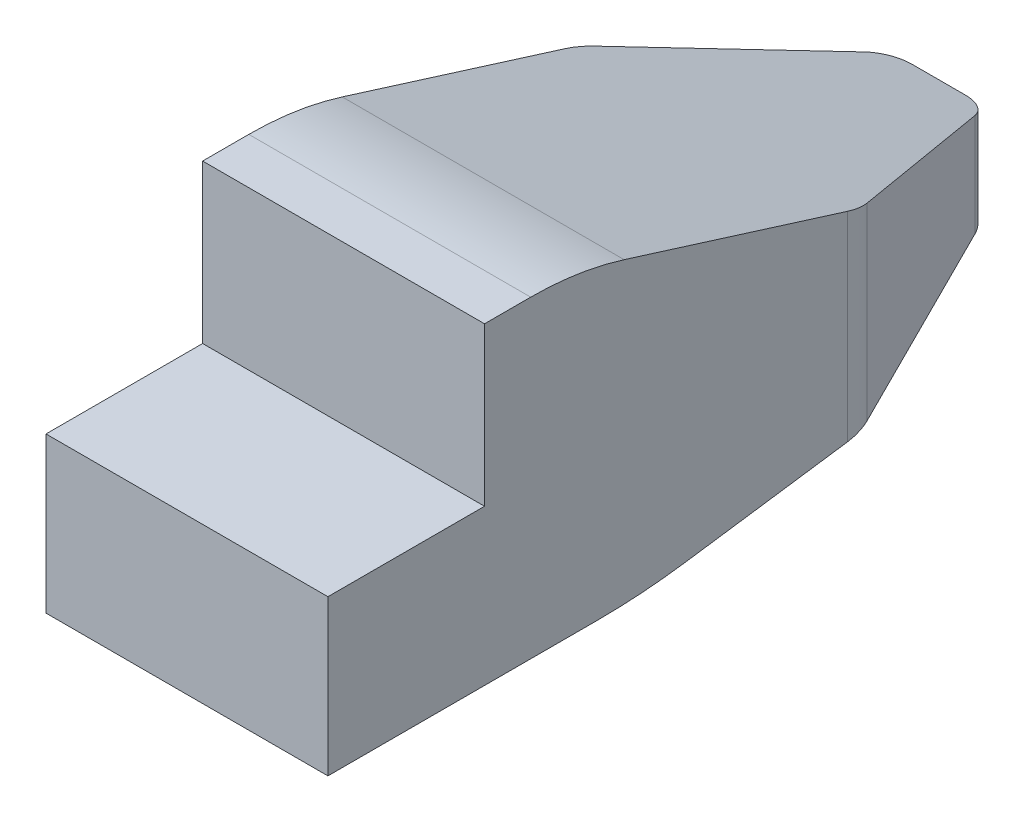
ISO-10303-21;
HEADER;
FILE_DESCRIPTION(('STEP AP214'),'2;1');
FILE_NAME('part.step','',(''),(''),'','','');
FILE_SCHEMA(('AUTOMOTIVE_DESIGN { 1 0 10303 214 1 1 1 1 }'));
ENDSEC;
DATA;
#1=APPLICATION_CONTEXT('core data for automotive mechanical design processes');
#2=APPLICATION_PROTOCOL_DEFINITION('international standard','automotive_design',2000,#1);
#3=PRODUCT_CONTEXT('',#1,'mechanical');
#4=PRODUCT('Part','Part','',(#3));
#5=PRODUCT_RELATED_PRODUCT_CATEGORY('part','',(#4));
#6=PRODUCT_DEFINITION_FORMATION('','',#4);
#7=PRODUCT_DEFINITION_CONTEXT('part definition',#1,'design');
#8=PRODUCT_DEFINITION('design','',#6,#7);
#9=PRODUCT_DEFINITION_SHAPE('','',#8);
#10=(LENGTH_UNIT() NAMED_UNIT(*) SI_UNIT(.MILLI.,.METRE.));
#11=(NAMED_UNIT(*) PLANE_ANGLE_UNIT() SI_UNIT($,.RADIAN.));
#12=(NAMED_UNIT(*) SI_UNIT($,.STERADIAN.) SOLID_ANGLE_UNIT());
#13=UNCERTAINTY_MEASURE_WITH_UNIT(LENGTH_MEASURE(1.E-05),#10,'distance_accuracy_value','');
#14=(GEOMETRIC_REPRESENTATION_CONTEXT(3) GLOBAL_UNCERTAINTY_ASSIGNED_CONTEXT((#13)) GLOBAL_UNIT_ASSIGNED_CONTEXT((#10,
#11,#12)) REPRESENTATION_CONTEXT('',''));
#15=CARTESIAN_POINT('',(0.,0.,0.));
#16=DIRECTION('',(0.,0.,1.));
#17=DIRECTION('',(1.,0.,0.));
#18=AXIS2_PLACEMENT_3D('',#15,#16,#17);
#19=CARTESIAN_POINT('',(9.,10.,0.));
#20=DIRECTION('',(-1.,0.,0.));
#21=DIRECTION('',(0.,0.,1.));
#22=AXIS2_PLACEMENT_3D('',#19,#20,#21);
#23=PLANE('',#22);
#24=DIRECTION('',(0.,-0.298274993135947,-0.95447997803503));
#25=VECTOR('',#24,1.);
#26=CARTESIAN_POINT('',(9.,11.3879003558719,-3.55871886120996));
#27=LINE('',#26,#25);
#28=CARTESIAN_POINT('',(9.,9.5447997803503,-9.45664070287905));
#29=VERTEX_POINT('',#28);
#30=CARTESIAN_POINT('',(9.,7.31578606372165,-16.5894845960907));
#31=VERTEX_POINT('',#30);
#32=EDGE_CURVE('E238',#29,#31,#27,.T.);
#33=ORIENTED_EDGE('',*,*,#32,.F.);
#34=CARTESIAN_POINT('',(9.,0.,-6.47389077151958));
#35=DIRECTION('',(-1.,0.,0.));
#36=DIRECTION('',(0.,0.,1.));
#37=AXIS2_PLACEMENT_3D('',#34,#35,#36);
#38=CIRCLE('',#37,10.);
#39=CARTESIAN_POINT('',(9.,10.,-6.47389077151958));
#40=VERTEX_POINT('',#39);
#41=EDGE_CURVE('E55',#29,#40,#38,.F.);
#42=ORIENTED_EDGE('',*,*,#41,.T.);
#43=DIRECTION('',(0.,0.,-1.));
#44=VECTOR('',#43,1.);
#45=CARTESIAN_POINT('',(9.,10.,0.));
#46=LINE('',#45,#44);
#47=CARTESIAN_POINT('',(9.,10.,-5.));
#48=VERTEX_POINT('',#47);
#49=EDGE_CURVE('E170',#48,#40,#46,.T.);
#50=ORIENTED_EDGE('',*,*,#49,.F.);
#51=DIRECTION('',(0.,1.,0.));
#52=VECTOR('',#51,1.);
#53=CARTESIAN_POINT('',(9.,4.95495,-5.));
#54=LINE('',#53,#52);
#55=CARTESIAN_POINT('',(9.,4.95495,-5.));
#56=VERTEX_POINT('',#55);
#57=EDGE_CURVE('E162',#56,#48,#54,.T.);
#58=ORIENTED_EDGE('',*,*,#57,.F.);
#59=DIRECTION('',(0.,0.,-1.));
#60=VECTOR('',#59,1.);
#61=CARTESIAN_POINT('',(9.,4.95495,0.));
#62=LINE('',#61,#60);
#63=CARTESIAN_POINT('',(9.,4.95495,0.));
#64=VERTEX_POINT('',#63);
#65=EDGE_CURVE('E149',#64,#56,#62,.T.);
#66=ORIENTED_EDGE('',*,*,#65,.F.);
#67=DIRECTION('',(0.,-1.,0.));
#68=VECTOR('',#67,1.);
#69=CARTESIAN_POINT('',(9.,10.,0.));
#70=LINE('',#69,#68);
#71=CARTESIAN_POINT('',(9.,0.,0.));
#72=VERTEX_POINT('',#71);
#73=EDGE_CURVE('E160',#64,#72,#70,.T.);
#74=ORIENTED_EDGE('',*,*,#73,.T.);
#75=DIRECTION('',(0.,0.,-1.));
#76=VECTOR('',#75,1.);
#77=CARTESIAN_POINT('',(9.,0.,0.));
#78=LINE('',#77,#76);
#79=CARTESIAN_POINT('',(9.,0.,-8.5786437626905));
#80=VERTEX_POINT('',#79);
#81=EDGE_CURVE('E177',#72,#80,#78,.T.);
#82=ORIENTED_EDGE('',*,*,#81,.T.);
#83=CARTESIAN_POINT('',(9.,20.,-8.5786437626905));
#84=DIRECTION('',(-1.,0.,0.));
#85=DIRECTION('',(0.,0.,1.));
#86=AXIS2_PLACEMENT_3D('',#83,#84,#85);
#87=CIRCLE('',#86,20.);
#88=CARTESIAN_POINT('',(9.,0.20101012677667,-11.4070708874367));
#89=VERTEX_POINT('',#88);
#90=EDGE_CURVE('E184',#80,#89,#87,.F.);
#91=ORIENTED_EDGE('',*,*,#90,.T.);
#92=DIRECTION('',(0.,-0.14142135623731,0.989949493661167));
#93=VECTOR('',#92,1.);
#94=CARTESIAN_POINT('',(9.,-1.4,-0.2));
#95=LINE('',#94,#93);
#96=CARTESIAN_POINT('',(9.,0.941354942298677,-16.5894845960907));
#97=VERTEX_POINT('',#96);
#98=EDGE_CURVE('E277',#97,#89,#95,.T.);
#99=ORIENTED_EDGE('',*,*,#98,.F.);
#100=DIRECTION('',(0.,-1.,0.));
#101=VECTOR('',#100,1.);
#102=CARTESIAN_POINT('',(9.,7.1875,-16.5894845960907));
#103=LINE('',#102,#101);
#104=EDGE_CURVE('E218',#97,#31,#103,.F.);
#105=ORIENTED_EDGE('',*,*,#104,.T.);
#106=EDGE_LOOP('',(#33,#42,#50,#58,#66,#74,#82,#91,#99,#105));
#107=FACE_BOUND('',#106,.T.);
#108=ADVANCED_FACE('F33',(#107),#23,.F.);
#109=CARTESIAN_POINT('',(9.,10.,-24.));
#110=DIRECTION('',(0.,0.,1.));
#111=DIRECTION('',(1.,0.,0.));
#112=AXIS2_PLACEMENT_3D('',#109,#110,#111);
#113=PLANE('',#112);
#114=DIRECTION('',(1.,0.,0.));
#115=VECTOR('',#114,1.);
#116=CARTESIAN_POINT('',(0.,5.,-24.));
#117=LINE('',#116,#115);
#118=CARTESIAN_POINT('',(3.65939615798056,5.,-24.));
#119=VERTEX_POINT('',#118);
#120=CARTESIAN_POINT('',(5.34060384201944,5.,-24.));
#121=VERTEX_POINT('',#120);
#122=EDGE_CURVE('E247',#119,#121,#117,.T.);
#123=ORIENTED_EDGE('',*,*,#122,.T.);
#124=DIRECTION('',(0.,-1.,0.));
#125=VECTOR('',#124,1.);
#126=CARTESIAN_POINT('',(5.34060384201944,2.,-24.));
#127=LINE('',#126,#125);
#128=CARTESIAN_POINT('',(5.34060384201944,2.,-24.));
#129=VERTEX_POINT('',#128);
#130=EDGE_CURVE('E194',#121,#129,#127,.T.);
#131=ORIENTED_EDGE('',*,*,#130,.T.);
#132=DIRECTION('',(1.,0.,0.));
#133=VECTOR('',#132,1.);
#134=CARTESIAN_POINT('',(0.,2.,-24.));
#135=LINE('',#134,#133);
#136=CARTESIAN_POINT('',(3.65939615798056,2.,-24.));
#137=VERTEX_POINT('',#136);
#138=EDGE_CURVE('E245',#137,#129,#135,.T.);
#139=ORIENTED_EDGE('',*,*,#138,.F.);
#140=DIRECTION('',(0.,-1.,0.));
#141=VECTOR('',#140,1.);
#142=CARTESIAN_POINT('',(3.65939615798056,10.,-24.));
#143=LINE('',#142,#141);
#144=EDGE_CURVE('E192',#137,#119,#143,.F.);
#145=ORIENTED_EDGE('',*,*,#144,.T.);
#146=EDGE_LOOP('',(#123,#131,#139,#145));
#147=FACE_BOUND('',#146,.T.);
#148=ADVANCED_FACE('F313',(#147),#113,.F.);
#149=CARTESIAN_POINT('',(0.,11.3879003558719,-3.55871886120996));
#150=DIRECTION('',(0.,-0.95447997803503,0.298274993135947));
#151=DIRECTION('',(0.,-0.298274993135947,-0.95447997803503));
#152=AXIS2_PLACEMENT_3D('',#149,#150,#151);
#153=PLANE('',#152);
#154=DIRECTION('',(0.,-0.298274993135947,-0.95447997803503));
#155=VECTOR('',#154,1.);
#156=CARTESIAN_POINT('',(0.,11.3879003558719,-3.55871886120996));
#157=LINE('',#156,#155);
#158=CARTESIAN_POINT('',(0.,9.5447997803503,-9.45664070287905));
#159=VERTEX_POINT('',#158);
#160=CARTESIAN_POINT('',(0.,7.31578606372165,-16.5894845960907));
#161=VERTEX_POINT('',#160);
#162=EDGE_CURVE('E239',#159,#161,#157,.T.);
#163=ORIENTED_EDGE('',*,*,#162,.F.);
#164=DIRECTION('',(1.,0.,0.));
#165=VECTOR('',#164,1.);
#166=CARTESIAN_POINT('',(9.,9.5447997803503,-9.45664070287905));
#167=LINE('',#166,#165);
#168=EDGE_CURVE('E231',#159,#29,#167,.T.);
#169=ORIENTED_EDGE('',*,*,#168,.T.);
#170=ORIENTED_EDGE('',*,*,#32,.T.);
#171=CARTESIAN_POINT('',(7.,7.31578606372165,-16.5894845960907));
#172=DIRECTION('',(0.,-0.95447997803503,0.298274993135947));
#173=DIRECTION('',(0.,0.298274993135947,0.95447997803503));
#174=AXIS2_PLACEMENT_3D('',#171,#172,#173);
#175=ELLIPSE('',#174,2.09538182678003,2.);
#176=CARTESIAN_POINT('',(8.83829006003611,7.06958650210967,-17.3773231932491));
#177=VERTEX_POINT('',#176);
#178=EDGE_CURVE('E224',#31,#177,#175,.F.);
#179=ORIENTED_EDGE('',*,*,#178,.T.);
#180=DIRECTION('',(0.378610596719421,0.276070226774578,0.883424725678649));
#181=VECTOR('',#180,1.);
#182=CARTESIAN_POINT('',(12.6446836309339,9.84508181422261,-8.49573819448765));
#183=LINE('',#182,#181);
#184=CARTESIAN_POINT('',(6.2597488720375,5.18940021919401,-23.3939192985792));
#185=VERTEX_POINT('',#184);
#186=EDGE_CURVE('E278',#185,#177,#183,.T.);
#187=ORIENTED_EDGE('',*,*,#186,.F.);
#188=CARTESIAN_POINT('',(5.34060384201944,5.3125,-23.));
#189=DIRECTION('',(0.,-0.95447997803503,0.298274993135947));
#190=DIRECTION('',(0.,0.298274993135947,0.95447997803503));
#191=AXIS2_PLACEMENT_3D('',#188,#189,#190);
#192=ELLIPSE('',#191,1.04769091339001,1.);
#193=EDGE_CURVE('E206',#185,#121,#192,.F.);
#194=ORIENTED_EDGE('',*,*,#193,.T.);
#195=ORIENTED_EDGE('',*,*,#122,.F.);
#196=CARTESIAN_POINT('',(3.65939615798056,5.3125,-23.));
#197=DIRECTION('',(0.,-0.95447997803503,0.298274993135947));
#198=DIRECTION('',(0.,-0.298274993135947,-0.95447997803503));
#199=AXIS2_PLACEMENT_3D('',#196,#197,#198);
#200=ELLIPSE('',#199,1.04769091339001,1.);
#201=CARTESIAN_POINT('',(2.7402511279625,5.18940021919401,-23.3939192985792));
#202=VERTEX_POINT('',#201);
#203=EDGE_CURVE('E204',#119,#202,#200,.F.);
#204=ORIENTED_EDGE('',*,*,#203,.T.);
#205=DIRECTION('',(-0.378610596719421,0.276070226774578,0.883424725678649));
#206=VECTOR('',#205,1.);
#207=CARTESIAN_POINT('',(-4.93479748646799,10.7857898338829,-5.48547253157469));
#208=LINE('',#207,#206);
#209=CARTESIAN_POINT('',(0.161709939963887,7.06958650210967,-17.3773231932491));
#210=VERTEX_POINT('',#209);
#211=EDGE_CURVE('E282',#202,#210,#208,.T.);
#212=ORIENTED_EDGE('',*,*,#211,.T.);
#213=CARTESIAN_POINT('',(2.,7.31578606372165,-16.5894845960907));
#214=DIRECTION('',(0.,-0.95447997803503,0.298274993135947));
#215=DIRECTION('',(0.,-0.298274993135947,-0.95447997803503));
#216=AXIS2_PLACEMENT_3D('',#213,#214,#215);
#217=ELLIPSE('',#216,2.09538182678003,2.);
#218=EDGE_CURVE('E221',#210,#161,#217,.F.);
#219=ORIENTED_EDGE('',*,*,#218,.T.);
#220=EDGE_LOOP('',(#163,#169,#170,#179,#187,#194,#195,#204,#212,#219));
#221=FACE_BOUND('',#220,.T.);
#222=ADVANCED_FACE('F237',(#221),#153,.F.);
#223=CARTESIAN_POINT('',(0.,-1.4,-0.2));
#224=DIRECTION('',(0.,0.989949493661166,0.141421356237309));
#225=DIRECTION('',(0.,-0.14142135623731,0.989949493661167));
#226=AXIS2_PLACEMENT_3D('',#223,#224,#225);
#227=PLANE('',#226);
#228=DIRECTION('',(-0.390566732942472,0.130188910980824,-0.911322376865767));
#229=VECTOR('',#228,1.);
#230=CARTESIAN_POINT('',(13.728813559322,-0.576271186440678,-5.96610169491525));
#231=LINE('',#230,#229);
#232=CARTESIAN_POINT('',(8.83829006003612,1.05390331332129,-17.3773231932491));
#233=VERTEX_POINT('',#232);
#234=CARTESIAN_POINT('',(6.2597488720375,1.91341704265417,-23.3939192985792));
#235=VERTEX_POINT('',#234);
#236=EDGE_CURVE('E172',#233,#235,#231,.T.);
#237=ORIENTED_EDGE('',*,*,#236,.F.);
#238=CARTESIAN_POINT('',(7.,0.941354942298675,-16.5894845960907));
#239=DIRECTION('',(0.,0.989949493661166,0.141421356237309));
#240=DIRECTION('',(0.,0.14142135623731,-0.989949493661167));
#241=AXIS2_PLACEMENT_3D('',#238,#239,#240);
#242=ELLIPSE('',#241,2.02030508910442,2.);
#243=EDGE_CURVE('E216',#233,#97,#242,.F.);
#244=ORIENTED_EDGE('',*,*,#243,.T.);
#245=ORIENTED_EDGE('',*,*,#98,.T.);
#246=DIRECTION('',(1.,0.,0.));
#247=VECTOR('',#246,1.);
#248=CARTESIAN_POINT('',(0.,0.201010126776669,-11.4070708874367));
#249=LINE('',#248,#247);
#250=CARTESIAN_POINT('',(0.,0.20101012677667,-11.4070708874367));
#251=VERTEX_POINT('',#250);
#252=EDGE_CURVE('E187',#89,#251,#249,.F.);
#253=ORIENTED_EDGE('',*,*,#252,.T.);
#254=DIRECTION('',(0.,-0.14142135623731,0.989949493661167));
#255=VECTOR('',#254,1.);
#256=CARTESIAN_POINT('',(0.,-1.4,-0.2));
#257=LINE('',#256,#255);
#258=CARTESIAN_POINT('',(0.,0.941354942298676,-16.5894845960907));
#259=VERTEX_POINT('',#258);
#260=EDGE_CURVE('E250',#259,#251,#257,.T.);
#261=ORIENTED_EDGE('',*,*,#260,.F.);
#262=CARTESIAN_POINT('',(2.,0.941354942298675,-16.5894845960907));
#263=DIRECTION('',(0.,0.989949493661166,0.141421356237309));
#264=DIRECTION('',(0.,-0.14142135623731,0.989949493661167));
#265=AXIS2_PLACEMENT_3D('',#262,#263,#264);
#266=ELLIPSE('',#265,2.02030508910442,2.);
#267=CARTESIAN_POINT('',(0.161709939963884,1.05390331332129,-17.3773231932491));
#268=VERTEX_POINT('',#267);
#269=EDGE_CURVE('E214',#259,#268,#266,.F.);
#270=ORIENTED_EDGE('',*,*,#269,.T.);
#271=DIRECTION('',(0.390566732942472,0.130188910980824,-0.911322376865767));
#272=VECTOR('',#271,1.);
#273=CARTESIAN_POINT('',(-6.10169491525424,-1.03389830508475,-2.76271186440678));
#274=LINE('',#273,#272);
#275=CARTESIAN_POINT('',(2.7402511279625,1.91341704265417,-23.3939192985792));
#276=VERTEX_POINT('',#275);
#277=EDGE_CURVE('E287',#268,#276,#274,.T.);
#278=ORIENTED_EDGE('',*,*,#277,.T.);
#279=CARTESIAN_POINT('',(3.65939615798056,1.85714285714286,-23.));
#280=DIRECTION('',(0.,0.989949493661166,0.141421356237309));
#281=DIRECTION('',(0.,-0.14142135623731,0.989949493661167));
#282=AXIS2_PLACEMENT_3D('',#279,#280,#281);
#283=ELLIPSE('',#282,1.01015254455221,1.);
#284=EDGE_CURVE('E197',#276,#137,#283,.F.);
#285=ORIENTED_EDGE('',*,*,#284,.T.);
#286=ORIENTED_EDGE('',*,*,#138,.T.);
#287=CARTESIAN_POINT('',(5.34060384201944,1.85714285714286,-23.));
#288=DIRECTION('',(0.,0.989949493661166,0.141421356237309));
#289=DIRECTION('',(0.,0.14142135623731,-0.989949493661167));
#290=AXIS2_PLACEMENT_3D('',#287,#288,#289);
#291=ELLIPSE('',#290,1.01015254455221,1.);
#292=EDGE_CURVE('E199',#129,#235,#291,.F.);
#293=ORIENTED_EDGE('',*,*,#292,.T.);
#294=EDGE_LOOP('',(#237,#244,#245,#253,#261,#270,#278,#285,#286,#293));
#295=FACE_BOUND('',#294,.T.);
#296=ADVANCED_FACE('F276',(#295),#227,.F.);
#297=CARTESIAN_POINT('',(0.,10.,0.));
#298=DIRECTION('',(0.,0.,-1.));
#299=DIRECTION('',(-1.,0.,0.));
#300=AXIS2_PLACEMENT_3D('',#297,#298,#299);
#301=PLANE('',#300);
#302=DIRECTION('',(1.,0.,0.));
#303=VECTOR('',#302,1.);
#304=CARTESIAN_POINT('',(0.,4.95495,0.));
#305=LINE('',#304,#303);
#306=CARTESIAN_POINT('',(0.,4.95495,0.));
#307=VERTEX_POINT('',#306);
#308=EDGE_CURVE('E145',#307,#64,#305,.T.);
#309=ORIENTED_EDGE('',*,*,#308,.F.);
#310=DIRECTION('',(0.,-1.,0.));
#311=VECTOR('',#310,1.);
#312=CARTESIAN_POINT('',(0.,10.,0.));
#313=LINE('',#312,#311);
#314=CARTESIAN_POINT('',(0.,0.,0.));
#315=VERTEX_POINT('',#314);
#316=EDGE_CURVE('E169',#307,#315,#313,.T.);
#317=ORIENTED_EDGE('',*,*,#316,.T.);
#318=DIRECTION('',(1.,0.,0.));
#319=VECTOR('',#318,1.);
#320=CARTESIAN_POINT('',(0.,0.,0.));
#321=LINE('',#320,#319);
#322=EDGE_CURVE('E167',#315,#72,#321,.T.);
#323=ORIENTED_EDGE('',*,*,#322,.T.);
#324=ORIENTED_EDGE('',*,*,#73,.F.);
#325=EDGE_LOOP('',(#309,#317,#323,#324));
#326=FACE_BOUND('',#325,.T.);
#327=ADVANCED_FACE('F165',(#326),#301,.F.);
#328=CARTESIAN_POINT('',(0.,10.,-24.));
#329=DIRECTION('',(1.,0.,0.));
#330=DIRECTION('',(0.,0.,-1.));
#331=AXIS2_PLACEMENT_3D('',#328,#329,#330);
#332=PLANE('',#331);
#333=DIRECTION('',(0.,0.,1.));
#334=VECTOR('',#333,1.);
#335=CARTESIAN_POINT('',(0.,10.,-24.));
#336=LINE('',#335,#334);
#337=CARTESIAN_POINT('',(0.,10.,-6.47389077151958));
#338=VERTEX_POINT('',#337);
#339=CARTESIAN_POINT('',(0.,10.,-5.));
#340=VERTEX_POINT('',#339);
#341=EDGE_CURVE('E174',#338,#340,#336,.T.);
#342=ORIENTED_EDGE('',*,*,#341,.F.);
#343=CARTESIAN_POINT('',(0.,0.,-6.47389077151958));
#344=DIRECTION('',(1.,0.,0.));
#345=DIRECTION('',(0.,0.,-1.));
#346=AXIS2_PLACEMENT_3D('',#343,#344,#345);
#347=CIRCLE('',#346,10.);
#348=EDGE_CURVE('E11',#338,#159,#347,.F.);
#349=ORIENTED_EDGE('',*,*,#348,.T.);
#350=ORIENTED_EDGE('',*,*,#162,.T.);
#351=DIRECTION('',(0.,-1.,0.));
#352=VECTOR('',#351,1.);
#353=CARTESIAN_POINT('',(0.,10.,-16.5894845960907));
#354=LINE('',#353,#352);
#355=EDGE_CURVE('E226',#161,#259,#354,.T.);
#356=ORIENTED_EDGE('',*,*,#355,.T.);
#357=ORIENTED_EDGE('',*,*,#260,.T.);
#358=CARTESIAN_POINT('',(0.,20.,-8.5786437626905));
#359=DIRECTION('',(1.,0.,0.));
#360=DIRECTION('',(0.,0.,-1.));
#361=AXIS2_PLACEMENT_3D('',#358,#359,#360);
#362=CIRCLE('',#361,20.);
#363=CARTESIAN_POINT('',(0.,0.,-8.5786437626905));
#364=VERTEX_POINT('',#363);
#365=EDGE_CURVE('E190',#251,#364,#362,.F.);
#366=ORIENTED_EDGE('',*,*,#365,.T.);
#367=DIRECTION('',(0.,0.,1.));
#368=VECTOR('',#367,1.);
#369=CARTESIAN_POINT('',(0.,0.,-24.));
#370=LINE('',#369,#368);
#371=EDGE_CURVE('E262',#364,#315,#370,.T.);
#372=ORIENTED_EDGE('',*,*,#371,.T.);
#373=ORIENTED_EDGE('',*,*,#316,.F.);
#374=DIRECTION('',(0.,0.,1.));
#375=VECTOR('',#374,1.);
#376=CARTESIAN_POINT('',(0.,4.95495,-5.));
#377=LINE('',#376,#375);
#378=CARTESIAN_POINT('',(0.,4.95495,-5.));
#379=VERTEX_POINT('',#378);
#380=EDGE_CURVE('E152',#379,#307,#377,.T.);
#381=ORIENTED_EDGE('',*,*,#380,.F.);
#382=DIRECTION('',(0.,1.,0.));
#383=VECTOR('',#382,1.);
#384=CARTESIAN_POINT('',(0.,4.95495,-5.));
#385=LINE('',#384,#383);
#386=EDGE_CURVE('E259',#379,#340,#385,.T.);
#387=ORIENTED_EDGE('',*,*,#386,.T.);
#388=EDGE_LOOP('',(#342,#349,#350,#356,#357,#366,#372,#373,#381,#387));
#389=FACE_BOUND('',#388,.T.);
#390=ADVANCED_FACE('F306',(#389),#332,.F.);
#391=CARTESIAN_POINT('',(0.,10.,0.));
#392=DIRECTION('',(0.,1.,0.));
#393=DIRECTION('',(0.,0.,1.));
#394=AXIS2_PLACEMENT_3D('',#391,#392,#393);
#395=PLANE('',#394);
#396=ORIENTED_EDGE('',*,*,#49,.T.);
#397=DIRECTION('',(1.,0.,0.));
#398=VECTOR('',#397,1.);
#399=CARTESIAN_POINT('',(0.,10.,-6.47389077151958));
#400=LINE('',#399,#398);
#401=EDGE_CURVE('E41',#40,#338,#400,.F.);
#402=ORIENTED_EDGE('',*,*,#401,.T.);
#403=ORIENTED_EDGE('',*,*,#341,.T.);
#404=DIRECTION('',(-1.,0.,0.));
#405=VECTOR('',#404,1.);
#406=CARTESIAN_POINT('',(9.,10.,-5.));
#407=LINE('',#406,#405);
#408=EDGE_CURVE('E157',#48,#340,#407,.T.);
#409=ORIENTED_EDGE('',*,*,#408,.F.);
#410=EDGE_LOOP('',(#396,#402,#403,#409));
#411=FACE_BOUND('',#410,.T.);
#412=ADVANCED_FACE('F326',(#411),#395,.T.);
#413=CARTESIAN_POINT('',(0.,0.,0.));
#414=DIRECTION('',(0.,1.,0.));
#415=DIRECTION('',(0.,0.,1.));
#416=AXIS2_PLACEMENT_3D('',#413,#414,#415);
#417=PLANE('',#416);
#418=ORIENTED_EDGE('',*,*,#371,.F.);
#419=DIRECTION('',(1.,0.,0.));
#420=VECTOR('',#419,1.);
#421=CARTESIAN_POINT('',(0.,0.,-8.5786437626905));
#422=LINE('',#421,#420);
#423=EDGE_CURVE('E181',#364,#80,#422,.T.);
#424=ORIENTED_EDGE('',*,*,#423,.T.);
#425=ORIENTED_EDGE('',*,*,#81,.F.);
#426=ORIENTED_EDGE('',*,*,#322,.F.);
#427=EDGE_LOOP('',(#418,#424,#425,#426));
#428=FACE_BOUND('',#427,.T.);
#429=ADVANCED_FACE('F268',(#428),#417,.F.);
#430=CARTESIAN_POINT('',(9.,4.95495,-5.));
#431=DIRECTION('',(0.,0.,-1.));
#432=DIRECTION('',(-1.,0.,0.));
#433=AXIS2_PLACEMENT_3D('',#430,#431,#432);
#434=PLANE('',#433);
#435=ORIENTED_EDGE('',*,*,#408,.T.);
#436=ORIENTED_EDGE('',*,*,#386,.F.);
#437=DIRECTION('',(-1.,0.,0.));
#438=VECTOR('',#437,1.);
#439=CARTESIAN_POINT('',(9.,4.95495,-5.));
#440=LINE('',#439,#438);
#441=EDGE_CURVE('E163',#56,#379,#440,.T.);
#442=ORIENTED_EDGE('',*,*,#441,.F.);
#443=ORIENTED_EDGE('',*,*,#57,.T.);
#444=EDGE_LOOP('',(#435,#436,#442,#443));
#445=FACE_BOUND('',#444,.T.);
#446=ADVANCED_FACE('F353',(#445),#434,.F.);
#447=CARTESIAN_POINT('',(0.,4.95495,0.));
#448=DIRECTION('',(0.,1.,0.));
#449=DIRECTION('',(0.,0.,1.));
#450=AXIS2_PLACEMENT_3D('',#447,#448,#449);
#451=PLANE('',#450);
#452=ORIENTED_EDGE('',*,*,#308,.T.);
#453=ORIENTED_EDGE('',*,*,#65,.T.);
#454=ORIENTED_EDGE('',*,*,#441,.T.);
#455=ORIENTED_EDGE('',*,*,#380,.T.);
#456=EDGE_LOOP('',(#452,#453,#454,#455));
#457=FACE_BOUND('',#456,.T.);
#458=ADVANCED_FACE('F147',(#457),#451,.T.);
#459=CARTESIAN_POINT('',(13.7586206896552,10.,-5.89655172413793));
#460=DIRECTION('',(0.919145030018058,0.,-0.393919298579168));
#461=DIRECTION('',(-0.393919298579168,0.,-0.919145030018058));
#462=AXIS2_PLACEMENT_3D('',#459,#460,#461);
#463=PLANE('',#462);
#464=ORIENTED_EDGE('',*,*,#186,.T.);
#465=DIRECTION('',(0.,-1.,0.));
#466=VECTOR('',#465,1.);
#467=CARTESIAN_POINT('',(8.83829006003612,0.999999999999999,-17.3773231932491));
#468=LINE('',#467,#466);
#469=EDGE_CURVE('E211',#177,#233,#468,.T.);
#470=ORIENTED_EDGE('',*,*,#469,.T.);
#471=ORIENTED_EDGE('',*,*,#236,.T.);
#472=DIRECTION('',(0.,-1.,0.));
#473=VECTOR('',#472,1.);
#474=CARTESIAN_POINT('',(6.2597488720375,5.,-23.3939192985792));
#475=LINE('',#474,#473);
#476=EDGE_CURVE('E202',#235,#185,#475,.F.);
#477=ORIENTED_EDGE('',*,*,#476,.T.);
#478=EDGE_LOOP('',(#464,#470,#471,#477));
#479=FACE_BOUND('',#478,.T.);
#480=ADVANCED_FACE('F343',(#479),#463,.T.);
#481=CARTESIAN_POINT('',(-6.1551724137931,10.,-2.63793103448276));
#482=DIRECTION('',(0.919145030018058,0.,0.393919298579168));
#483=DIRECTION('',(0.393919298579168,0.,-0.919145030018058));
#484=AXIS2_PLACEMENT_3D('',#481,#482,#483);
#485=PLANE('',#484);
#486=ORIENTED_EDGE('',*,*,#277,.F.);
#487=DIRECTION('',(0.,-1.,0.));
#488=VECTOR('',#487,1.);
#489=CARTESIAN_POINT('',(0.161709939963886,10.,-17.3773231932491));
#490=LINE('',#489,#488);
#491=EDGE_CURVE('E229',#268,#210,#490,.F.);
#492=ORIENTED_EDGE('',*,*,#491,.T.);
#493=ORIENTED_EDGE('',*,*,#211,.F.);
#494=DIRECTION('',(0.,-1.,0.));
#495=VECTOR('',#494,1.);
#496=CARTESIAN_POINT('',(2.7402511279625,10.,-23.3939192985792));
#497=LINE('',#496,#495);
#498=EDGE_CURVE('E208',#202,#276,#497,.T.);
#499=ORIENTED_EDGE('',*,*,#498,.T.);
#500=EDGE_LOOP('',(#486,#492,#493,#499));
#501=FACE_BOUND('',#500,.T.);
#502=ADVANCED_FACE('F299',(#501),#485,.F.);
#503=CARTESIAN_POINT('',(0.,20.,-8.5786437626905));
#504=DIRECTION('',(1.,0.,0.));
#505=DIRECTION('',(0.,0.,-1.));
#506=AXIS2_PLACEMENT_3D('',#503,#504,#505);
#507=CYLINDRICAL_SURFACE('',#506,20.);
#508=ORIENTED_EDGE('',*,*,#365,.F.);
#509=ORIENTED_EDGE('',*,*,#252,.F.);
#510=ORIENTED_EDGE('',*,*,#90,.F.);
#511=ORIENTED_EDGE('',*,*,#423,.F.);
#512=EDGE_LOOP('',(#508,#509,#510,#511));
#513=FACE_BOUND('',#512,.T.);
#514=ADVANCED_FACE('F272',(#513),#507,.T.);
#515=CARTESIAN_POINT('',(5.34060384201944,10.,-23.));
#516=DIRECTION('',(0.,1.,0.));
#517=DIRECTION('',(0.,0.,1.));
#518=AXIS2_PLACEMENT_3D('',#515,#516,#517);
#519=CYLINDRICAL_SURFACE('',#518,1.);
#520=ORIENTED_EDGE('',*,*,#193,.F.);
#521=ORIENTED_EDGE('',*,*,#476,.F.);
#522=ORIENTED_EDGE('',*,*,#292,.F.);
#523=ORIENTED_EDGE('',*,*,#130,.F.);
#524=EDGE_LOOP('',(#520,#521,#522,#523));
#525=FACE_BOUND('',#524,.T.);
#526=ADVANCED_FACE('F329',(#525),#519,.T.);
#527=CARTESIAN_POINT('',(3.65939615798056,10.,-23.));
#528=DIRECTION('',(0.,-1.,0.));
#529=DIRECTION('',(0.,0.,-1.));
#530=AXIS2_PLACEMENT_3D('',#527,#528,#529);
#531=CYLINDRICAL_SURFACE('',#530,1.);
#532=ORIENTED_EDGE('',*,*,#203,.F.);
#533=ORIENTED_EDGE('',*,*,#144,.F.);
#534=ORIENTED_EDGE('',*,*,#284,.F.);
#535=ORIENTED_EDGE('',*,*,#498,.F.);
#536=EDGE_LOOP('',(#532,#533,#534,#535));
#537=FACE_BOUND('',#536,.T.);
#538=ADVANCED_FACE('F297',(#537),#531,.T.);
#539=CARTESIAN_POINT('',(7.,10.,-16.5894845960907));
#540=DIRECTION('',(0.,1.,0.));
#541=DIRECTION('',(0.,0.,1.));
#542=AXIS2_PLACEMENT_3D('',#539,#540,#541);
#543=CYLINDRICAL_SURFACE('',#542,2.);
#544=ORIENTED_EDGE('',*,*,#178,.F.);
#545=ORIENTED_EDGE('',*,*,#104,.F.);
#546=ORIENTED_EDGE('',*,*,#243,.F.);
#547=ORIENTED_EDGE('',*,*,#469,.F.);
#548=EDGE_LOOP('',(#544,#545,#546,#547));
#549=FACE_BOUND('',#548,.T.);
#550=ADVANCED_FACE('F311',(#549),#543,.T.);
#551=CARTESIAN_POINT('',(2.,10.,-16.5894845960907));
#552=DIRECTION('',(0.,-1.,0.));
#553=DIRECTION('',(0.,0.,-1.));
#554=AXIS2_PLACEMENT_3D('',#551,#552,#553);
#555=CYLINDRICAL_SURFACE('',#554,2.);
#556=ORIENTED_EDGE('',*,*,#218,.F.);
#557=ORIENTED_EDGE('',*,*,#491,.F.);
#558=ORIENTED_EDGE('',*,*,#269,.F.);
#559=ORIENTED_EDGE('',*,*,#355,.F.);
#560=EDGE_LOOP('',(#556,#557,#558,#559));
#561=FACE_BOUND('',#560,.T.);
#562=ADVANCED_FACE('F304',(#561),#555,.T.);
#563=CARTESIAN_POINT('',(0.,0.,-6.47389077151958));
#564=DIRECTION('',(-1.,0.,0.));
#565=DIRECTION('',(0.,0.,1.));
#566=AXIS2_PLACEMENT_3D('',#563,#564,#565);
#567=CYLINDRICAL_SURFACE('',#566,10.);
#568=ORIENTED_EDGE('',*,*,#348,.F.);
#569=ORIENTED_EDGE('',*,*,#401,.F.);
#570=ORIENTED_EDGE('',*,*,#41,.F.);
#571=ORIENTED_EDGE('',*,*,#168,.F.);
#572=EDGE_LOOP('',(#568,#569,#570,#571));
#573=FACE_BOUND('',#572,.T.);
#574=ADVANCED_FACE('F35',(#573),#567,.T.);
#575=CLOSED_SHELL('',(#108,#148,#222,#296,#327,#390,#412,#429,#446,#458,#480,#502,#514,#526,
#538,#550,#562,#574));
#576=MANIFOLD_SOLID_BREP('B2',#575);
#577=ADVANCED_BREP_SHAPE_REPRESENTATION('',(#18,#576),#14);
#578=SHAPE_DEFINITION_REPRESENTATION(#9,#577);
ENDSEC;
END-ISO-10303-21;
